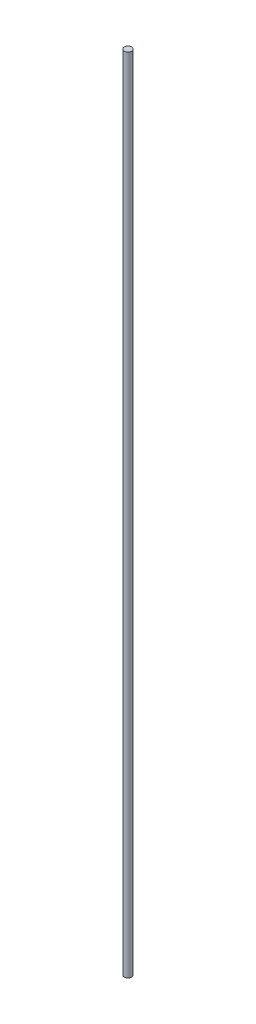
ISO-10303-21;
HEADER;
FILE_DESCRIPTION(('STEP AP214'),'2;1');
FILE_NAME('part.step','',(''),(''),'','','');
FILE_SCHEMA(('AUTOMOTIVE_DESIGN { 1 0 10303 214 1 1 1 1 }'));
ENDSEC;
DATA;
#1=APPLICATION_CONTEXT('core data for automotive mechanical design processes');
#2=APPLICATION_PROTOCOL_DEFINITION('international standard','automotive_design',2000,#1);
#3=PRODUCT_CONTEXT('',#1,'mechanical');
#4=PRODUCT('Part','Part','',(#3));
#5=PRODUCT_RELATED_PRODUCT_CATEGORY('part','',(#4));
#6=PRODUCT_DEFINITION_FORMATION('','',#4);
#7=PRODUCT_DEFINITION_CONTEXT('part definition',#1,'design');
#8=PRODUCT_DEFINITION('design','',#6,#7);
#9=PRODUCT_DEFINITION_SHAPE('','',#8);
#10=(LENGTH_UNIT() NAMED_UNIT(*) SI_UNIT(.MILLI.,.METRE.));
#11=(NAMED_UNIT(*) PLANE_ANGLE_UNIT() SI_UNIT($,.RADIAN.));
#12=(NAMED_UNIT(*) SI_UNIT($,.STERADIAN.) SOLID_ANGLE_UNIT());
#13=UNCERTAINTY_MEASURE_WITH_UNIT(LENGTH_MEASURE(1.E-05),#10,'distance_accuracy_value','');
#14=(GEOMETRIC_REPRESENTATION_CONTEXT(3) GLOBAL_UNCERTAINTY_ASSIGNED_CONTEXT((#13)) GLOBAL_UNIT_ASSIGNED_CONTEXT((#10,
#11,#12)) REPRESENTATION_CONTEXT('',''));
#15=CARTESIAN_POINT('',(0.,0.,0.));
#16=DIRECTION('',(0.,0.,1.));
#17=DIRECTION('',(1.,0.,0.));
#18=AXIS2_PLACEMENT_3D('',#15,#16,#17);
#19=CARTESIAN_POINT('',(0.,342.9,0.));
#20=DIRECTION('',(0.,-1.,0.));
#21=DIRECTION('',(0.,0.,-1.));
#22=AXIS2_PLACEMENT_3D('',#19,#20,#21);
#23=CYLINDRICAL_SURFACE('',#22,3.175);
#24=CARTESIAN_POINT('',(0.,342.9,0.));
#25=DIRECTION('',(0.,1.,0.));
#26=DIRECTION('',(0.,0.,1.));
#27=AXIS2_PLACEMENT_3D('',#24,#25,#26);
#28=CIRCLE('',#27,3.175);
#29=CARTESIAN_POINT('',(0.,342.9,3.175));
#30=VERTEX_POINT('',#29);
#31=EDGE_CURVE('E10',#30,#30,#28,.T.);
#32=ORIENTED_EDGE('',*,*,#31,.F.);
#33=EDGE_LOOP('',(#32));
#34=FACE_BOUND('',#33,.T.);
#35=CARTESIAN_POINT('',(0.,-342.9,0.));
#36=DIRECTION('',(0.,1.,0.));
#37=DIRECTION('',(0.,0.,1.));
#38=AXIS2_PLACEMENT_3D('',#35,#36,#37);
#39=CIRCLE('',#38,3.175);
#40=CARTESIAN_POINT('',(0.,-342.9,3.175));
#41=VERTEX_POINT('',#40);
#42=EDGE_CURVE('E46',#41,#41,#39,.T.);
#43=ORIENTED_EDGE('',*,*,#42,.T.);
#44=EDGE_LOOP('',(#43));
#45=FACE_BOUND('',#44,.T.);
#46=ADVANCED_FACE('F43',(#34,#45),#23,.T.);
#47=CARTESIAN_POINT('',(0.,342.9,0.));
#48=DIRECTION('',(0.,1.,0.));
#49=DIRECTION('',(0.,0.,1.));
#50=AXIS2_PLACEMENT_3D('',#47,#48,#49);
#51=PLANE('',#50);
#52=ORIENTED_EDGE('',*,*,#31,.T.);
#53=EDGE_LOOP('',(#52));
#54=FACE_BOUND('',#53,.T.);
#55=ADVANCED_FACE('F60',(#54),#51,.T.);
#56=CARTESIAN_POINT('',(0.,-342.9,0.));
#57=DIRECTION('',(0.,1.,0.));
#58=DIRECTION('',(0.,0.,1.));
#59=AXIS2_PLACEMENT_3D('',#56,#57,#58);
#60=PLANE('',#59);
#61=ORIENTED_EDGE('',*,*,#42,.F.);
#62=EDGE_LOOP('',(#61));
#63=FACE_BOUND('',#62,.T.);
#64=ADVANCED_FACE('F58',(#63),#60,.F.);
#65=CLOSED_SHELL('',(#46,#55,#64));
#66=MANIFOLD_SOLID_BREP('B2',#65);
#67=ADVANCED_BREP_SHAPE_REPRESENTATION('',(#18,#66),#14);
#68=SHAPE_DEFINITION_REPRESENTATION(#9,#67);
ENDSEC;
END-ISO-10303-21;
